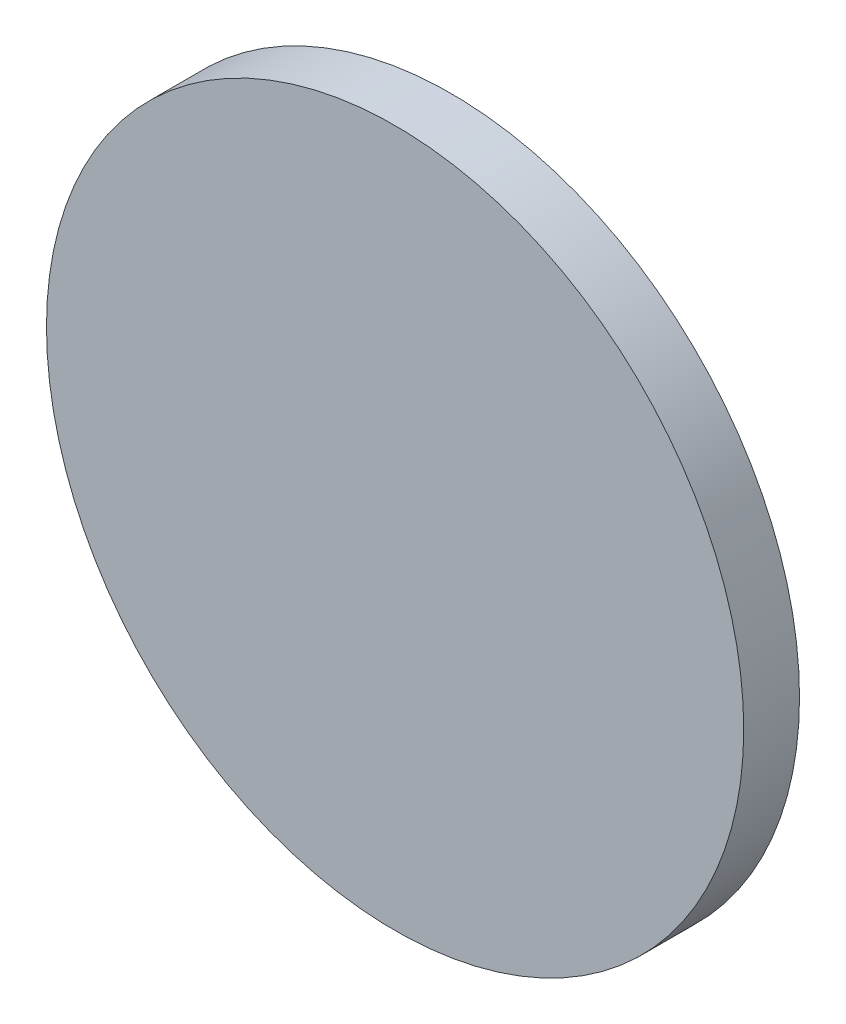
ISO-10303-21;
HEADER;
FILE_DESCRIPTION(('STEP AP214'),'2;1');
FILE_NAME('part.step','',(''),(''),'','','');
FILE_SCHEMA(('AUTOMOTIVE_DESIGN { 1 0 10303 214 1 1 1 1 }'));
ENDSEC;
DATA;
#1=APPLICATION_CONTEXT('core data for automotive mechanical design processes');
#2=APPLICATION_PROTOCOL_DEFINITION('international standard','automotive_design',2000,#1);
#3=PRODUCT_CONTEXT('',#1,'mechanical');
#4=PRODUCT('Part','Part','',(#3));
#5=PRODUCT_RELATED_PRODUCT_CATEGORY('part','',(#4));
#6=PRODUCT_DEFINITION_FORMATION('','',#4);
#7=PRODUCT_DEFINITION_CONTEXT('part definition',#1,'design');
#8=PRODUCT_DEFINITION('design','',#6,#7);
#9=PRODUCT_DEFINITION_SHAPE('','',#8);
#10=(LENGTH_UNIT() NAMED_UNIT(*) SI_UNIT(.MILLI.,.METRE.));
#11=(NAMED_UNIT(*) PLANE_ANGLE_UNIT() SI_UNIT($,.RADIAN.));
#12=(NAMED_UNIT(*) SI_UNIT($,.STERADIAN.) SOLID_ANGLE_UNIT());
#13=UNCERTAINTY_MEASURE_WITH_UNIT(LENGTH_MEASURE(1.E-05),#10,'distance_accuracy_value','');
#14=(GEOMETRIC_REPRESENTATION_CONTEXT(3) GLOBAL_UNCERTAINTY_ASSIGNED_CONTEXT((#13)) GLOBAL_UNIT_ASSIGNED_CONTEXT((#10,
#11,#12)) REPRESENTATION_CONTEXT('',''));
#15=CARTESIAN_POINT('',(0.,0.,0.));
#16=DIRECTION('',(0.,0.,1.));
#17=DIRECTION('',(1.,0.,0.));
#18=AXIS2_PLACEMENT_3D('',#15,#16,#17);
#19=CARTESIAN_POINT('',(0.,0.,-0.02));
#20=DIRECTION('',(0.,0.,1.));
#21=DIRECTION('',(1.,0.,0.));
#22=AXIS2_PLACEMENT_3D('',#19,#20,#21);
#23=PLANE('',#22);
#24=CARTESIAN_POINT('',(0.,0.,-0.02));
#25=DIRECTION('',(0.,0.,1.));
#26=DIRECTION('',(1.,0.,0.));
#27=AXIS2_PLACEMENT_3D('',#24,#25,#26);
#28=CIRCLE('',#27,0.125);
#29=CARTESIAN_POINT('',(-0.125,0.,-0.02));
#30=VERTEX_POINT('',#29);
#31=EDGE_CURVE('E11',#30,#30,#28,.T.);
#32=ORIENTED_EDGE('',*,*,#31,.F.);
#33=EDGE_LOOP('',(#32));
#34=FACE_BOUND('',#33,.T.);
#35=ADVANCED_FACE('F16',(#34),#23,.F.);
#36=CARTESIAN_POINT('',(0.,0.,0.));
#37=DIRECTION('',(0.,0.,1.));
#38=DIRECTION('',(1.,0.,0.));
#39=AXIS2_PLACEMENT_3D('',#36,#37,#38);
#40=PLANE('',#39);
#41=CARTESIAN_POINT('',(0.,0.,0.));
#42=DIRECTION('',(0.,0.,1.));
#43=DIRECTION('',(1.,0.,0.));
#44=AXIS2_PLACEMENT_3D('',#41,#42,#43);
#45=CIRCLE('',#44,0.125);
#46=CARTESIAN_POINT('',(-0.125,0.,0.));
#47=VERTEX_POINT('',#46);
#48=EDGE_CURVE('E20',#47,#47,#45,.T.);
#49=ORIENTED_EDGE('',*,*,#48,.T.);
#50=EDGE_LOOP('',(#49));
#51=FACE_BOUND('',#50,.T.);
#52=ADVANCED_FACE('F44',(#51),#40,.T.);
#53=CARTESIAN_POINT('',(0.,0.,-0.02));
#54=DIRECTION('',(0.,0.,1.));
#55=DIRECTION('',(1.,0.,0.));
#56=AXIS2_PLACEMENT_3D('',#53,#54,#55);
#57=CYLINDRICAL_SURFACE('',#56,0.125);
#58=ORIENTED_EDGE('',*,*,#48,.F.);
#59=DIRECTION('',(0.,0.,-1.));
#60=VECTOR('',#59,1.);
#61=CARTESIAN_POINT('',(-0.125,0.,-0.02));
#62=LINE('',#61,#60);
#63=EDGE_CURVE('E27',#47,#30,#62,.T.);
#64=ORIENTED_EDGE('',*,*,#63,.T.);
#65=ORIENTED_EDGE('',*,*,#31,.T.);
#66=ORIENTED_EDGE('',*,*,#63,.F.);
#67=EDGE_LOOP('',(#58,#64,#65,#66));
#68=FACE_BOUND('',#67,.T.);
#69=ADVANCED_FACE('F18',(#68),#57,.T.);
#70=CLOSED_SHELL('',(#35,#52,#69));
#71=MANIFOLD_SOLID_BREP('B1',#70);
#72=ADVANCED_BREP_SHAPE_REPRESENTATION('',(#18,#71),#14);
#73=SHAPE_DEFINITION_REPRESENTATION(#9,#72);
ENDSEC;
END-ISO-10303-21;
